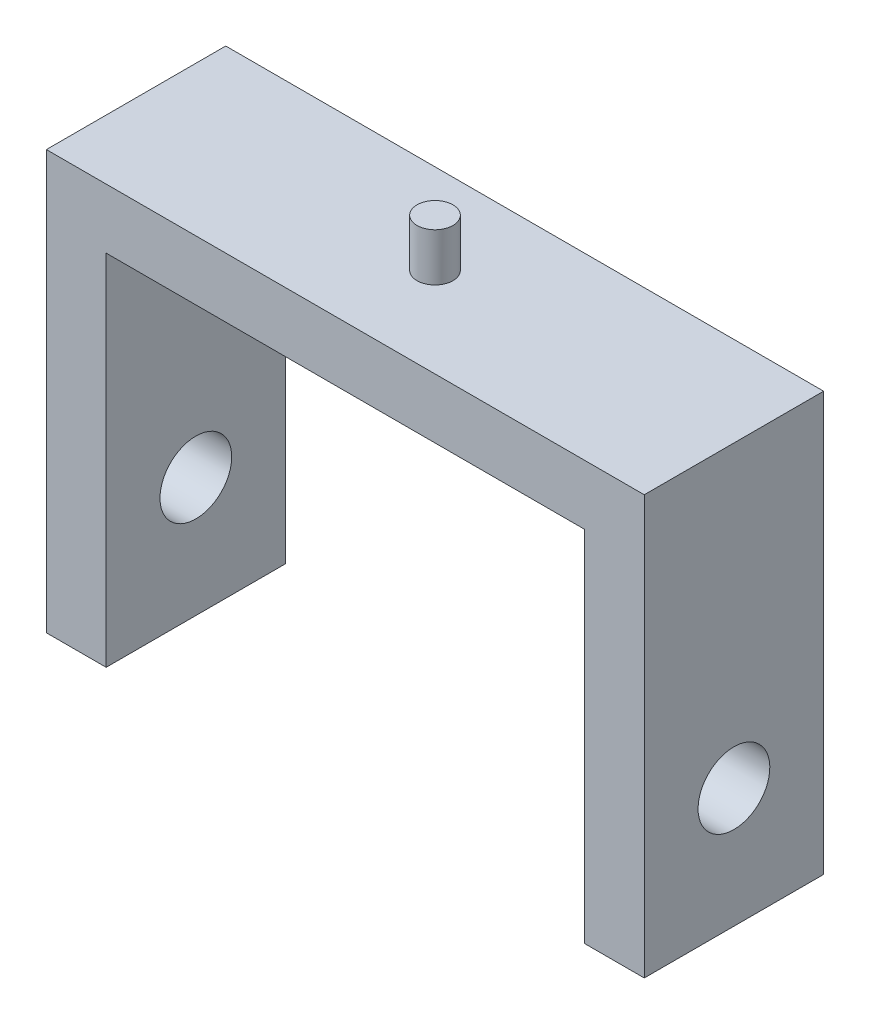
ISO-10303-21;
HEADER;
FILE_DESCRIPTION(('STEP AP214'),'2;1');
FILE_NAME('part.step','',(''),(''),'','','');
FILE_SCHEMA(('AUTOMOTIVE_DESIGN { 1 0 10303 214 1 1 1 1 }'));
ENDSEC;
DATA;
#1=APPLICATION_CONTEXT('core data for automotive mechanical design processes');
#2=APPLICATION_PROTOCOL_DEFINITION('international standard','automotive_design',2000,#1);
#3=PRODUCT_CONTEXT('',#1,'mechanical');
#4=PRODUCT('Part','Part','',(#3));
#5=PRODUCT_RELATED_PRODUCT_CATEGORY('part','',(#4));
#6=PRODUCT_DEFINITION_FORMATION('','',#4);
#7=PRODUCT_DEFINITION_CONTEXT('part definition',#1,'design');
#8=PRODUCT_DEFINITION('design','',#6,#7);
#9=PRODUCT_DEFINITION_SHAPE('','',#8);
#10=(LENGTH_UNIT() NAMED_UNIT(*) SI_UNIT(.MILLI.,.METRE.));
#11=(NAMED_UNIT(*) PLANE_ANGLE_UNIT() SI_UNIT($,.RADIAN.));
#12=(NAMED_UNIT(*) SI_UNIT($,.STERADIAN.) SOLID_ANGLE_UNIT());
#13=UNCERTAINTY_MEASURE_WITH_UNIT(LENGTH_MEASURE(1.E-05),#10,'distance_accuracy_value','');
#14=(GEOMETRIC_REPRESENTATION_CONTEXT(3) GLOBAL_UNCERTAINTY_ASSIGNED_CONTEXT((#13)) GLOBAL_UNIT_ASSIGNED_CONTEXT((#10,
#11,#12)) REPRESENTATION_CONTEXT('',''));
#15=CARTESIAN_POINT('',(0.,0.,0.));
#16=DIRECTION('',(0.,0.,1.));
#17=DIRECTION('',(1.,0.,0.));
#18=AXIS2_PLACEMENT_3D('',#15,#16,#17);
#19=CARTESIAN_POINT('',(-25.,15.,7.5));
#20=DIRECTION('',(1.,0.,0.));
#21=DIRECTION('',(0.,1.,0.));
#22=AXIS2_PLACEMENT_3D('',#19,#20,#21);
#23=PLANE('',#22);
#24=CARTESIAN_POINT('',(-25.,-5.,0.));
#25=DIRECTION('',(1.,0.,0.));
#26=DIRECTION('',(0.,1.,0.));
#27=AXIS2_PLACEMENT_3D('',#24,#25,#26);
#28=CIRCLE('',#27,3.);
#29=CARTESIAN_POINT('',(-25.,-2.,0.));
#30=VERTEX_POINT('',#29);
#31=EDGE_CURVE('E234',#30,#30,#28,.T.);
#32=ORIENTED_EDGE('',*,*,#31,.T.);
#33=EDGE_LOOP('',(#32));
#34=FACE_BOUND('',#33,.T.);
#35=DIRECTION('',(0.,-1.,0.));
#36=VECTOR('',#35,1.);
#37=CARTESIAN_POINT('',(-25.,15.,-7.5));
#38=LINE('',#37,#36);
#39=CARTESIAN_POINT('',(-25.,20.,-7.5));
#40=VERTEX_POINT('',#39);
#41=CARTESIAN_POINT('',(-25.,-15.,-7.5));
#42=VERTEX_POINT('',#41);
#43=EDGE_CURVE('E144',#40,#42,#38,.T.);
#44=ORIENTED_EDGE('',*,*,#43,.T.);
#45=DIRECTION('',(0.,0.,-1.));
#46=VECTOR('',#45,1.);
#47=CARTESIAN_POINT('',(-25.,-15.,7.5));
#48=LINE('',#47,#46);
#49=CARTESIAN_POINT('',(-25.,-15.,7.5));
#50=VERTEX_POINT('',#49);
#51=EDGE_CURVE('E49',#50,#42,#48,.T.);
#52=ORIENTED_EDGE('',*,*,#51,.F.);
#53=DIRECTION('',(0.,-1.,0.));
#54=VECTOR('',#53,1.);
#55=CARTESIAN_POINT('',(-25.,15.,7.5));
#56=LINE('',#55,#54);
#57=CARTESIAN_POINT('',(-25.,20.,7.5));
#58=VERTEX_POINT('',#57);
#59=EDGE_CURVE('E97',#58,#50,#56,.T.);
#60=ORIENTED_EDGE('',*,*,#59,.F.);
#61=DIRECTION('',(0.,0.,-1.));
#62=VECTOR('',#61,1.);
#63=CARTESIAN_POINT('',(-25.,20.,7.5));
#64=LINE('',#63,#62);
#65=EDGE_CURVE('E143',#58,#40,#64,.T.);
#66=ORIENTED_EDGE('',*,*,#65,.T.);
#67=EDGE_LOOP('',(#44,#52,#60,#66));
#68=FACE_BOUND('',#67,.T.);
#69=ADVANCED_FACE('F39',(#34,#68),#23,.F.);
#70=CARTESIAN_POINT('',(-20.,-15.,7.5));
#71=DIRECTION('',(0.,-1.,0.));
#72=DIRECTION('',(0.,0.,-1.));
#73=AXIS2_PLACEMENT_3D('',#70,#71,#72);
#74=PLANE('',#73);
#75=DIRECTION('',(-1.,0.,0.));
#76=VECTOR('',#75,1.);
#77=CARTESIAN_POINT('',(-20.,-15.,-7.5));
#78=LINE('',#77,#76);
#79=CARTESIAN_POINT('',(-20.,-15.,-7.5));
#80=VERTEX_POINT('',#79);
#81=EDGE_CURVE('E148',#80,#42,#78,.T.);
#82=ORIENTED_EDGE('',*,*,#81,.F.);
#83=DIRECTION('',(0.,0.,-1.));
#84=VECTOR('',#83,1.);
#85=CARTESIAN_POINT('',(-20.,-15.,7.5));
#86=LINE('',#85,#84);
#87=CARTESIAN_POINT('',(-20.,-15.,7.5));
#88=VERTEX_POINT('',#87);
#89=EDGE_CURVE('E183',#88,#80,#86,.T.);
#90=ORIENTED_EDGE('',*,*,#89,.F.);
#91=DIRECTION('',(-1.,0.,0.));
#92=VECTOR('',#91,1.);
#93=CARTESIAN_POINT('',(-20.,-15.,7.5));
#94=LINE('',#93,#92);
#95=EDGE_CURVE('E191',#88,#50,#94,.T.);
#96=ORIENTED_EDGE('',*,*,#95,.T.);
#97=ORIENTED_EDGE('',*,*,#51,.T.);
#98=EDGE_LOOP('',(#82,#90,#96,#97));
#99=FACE_BOUND('',#98,.T.);
#100=ADVANCED_FACE('F190',(#99),#74,.T.);
#101=CARTESIAN_POINT('',(-20.,15.,7.5));
#102=DIRECTION('',(1.,0.,0.));
#103=DIRECTION('',(0.,1.,0.));
#104=AXIS2_PLACEMENT_3D('',#101,#102,#103);
#105=PLANE('',#104);
#106=CARTESIAN_POINT('',(-20.,-5.,0.));
#107=DIRECTION('',(1.,0.,0.));
#108=DIRECTION('',(0.,1.,0.));
#109=AXIS2_PLACEMENT_3D('',#106,#107,#108);
#110=CIRCLE('',#109,3.);
#111=CARTESIAN_POINT('',(-20.,-2.,0.));
#112=VERTEX_POINT('',#111);
#113=EDGE_CURVE('E245',#112,#112,#110,.T.);
#114=ORIENTED_EDGE('',*,*,#113,.F.);
#115=EDGE_LOOP('',(#114));
#116=FACE_BOUND('',#115,.T.);
#117=DIRECTION('',(0.,-1.,0.));
#118=VECTOR('',#117,1.);
#119=CARTESIAN_POINT('',(-20.,15.,-7.5));
#120=LINE('',#119,#118);
#121=CARTESIAN_POINT('',(-20.,15.,-7.5));
#122=VERTEX_POINT('',#121);
#123=EDGE_CURVE('E153',#122,#80,#120,.T.);
#124=ORIENTED_EDGE('',*,*,#123,.F.);
#125=DIRECTION('',(0.,0.,-1.));
#126=VECTOR('',#125,1.);
#127=CARTESIAN_POINT('',(-20.,15.,7.5));
#128=LINE('',#127,#126);
#129=CARTESIAN_POINT('',(-20.,15.,7.5));
#130=VERTEX_POINT('',#129);
#131=EDGE_CURVE('E180',#130,#122,#128,.T.);
#132=ORIENTED_EDGE('',*,*,#131,.F.);
#133=DIRECTION('',(0.,-1.,0.));
#134=VECTOR('',#133,1.);
#135=CARTESIAN_POINT('',(-20.,15.,7.5));
#136=LINE('',#135,#134);
#137=EDGE_CURVE('E202',#130,#88,#136,.T.);
#138=ORIENTED_EDGE('',*,*,#137,.T.);
#139=ORIENTED_EDGE('',*,*,#89,.T.);
#140=EDGE_LOOP('',(#124,#132,#138,#139));
#141=FACE_BOUND('',#140,.T.);
#142=ADVANCED_FACE('F199',(#116,#141),#105,.T.);
#143=CARTESIAN_POINT('',(-20.,15.,7.5));
#144=DIRECTION('',(0.,-1.,0.));
#145=DIRECTION('',(0.,0.,-1.));
#146=AXIS2_PLACEMENT_3D('',#143,#144,#145);
#147=PLANE('',#146);
#148=DIRECTION('',(-1.,0.,0.));
#149=VECTOR('',#148,1.);
#150=CARTESIAN_POINT('',(-20.,15.,-7.5));
#151=LINE('',#150,#149);
#152=CARTESIAN_POINT('',(20.,15.,-7.5));
#153=VERTEX_POINT('',#152);
#154=EDGE_CURVE('E157',#153,#122,#151,.T.);
#155=ORIENTED_EDGE('',*,*,#154,.F.);
#156=DIRECTION('',(0.,0.,-1.));
#157=VECTOR('',#156,1.);
#158=CARTESIAN_POINT('',(20.,15.,7.5));
#159=LINE('',#158,#157);
#160=CARTESIAN_POINT('',(20.,15.,7.5));
#161=VERTEX_POINT('',#160);
#162=EDGE_CURVE('E177',#161,#153,#159,.T.);
#163=ORIENTED_EDGE('',*,*,#162,.F.);
#164=DIRECTION('',(-1.,0.,0.));
#165=VECTOR('',#164,1.);
#166=CARTESIAN_POINT('',(-20.,15.,7.5));
#167=LINE('',#166,#165);
#168=EDGE_CURVE('E137',#161,#130,#167,.T.);
#169=ORIENTED_EDGE('',*,*,#168,.T.);
#170=ORIENTED_EDGE('',*,*,#131,.T.);
#171=EDGE_LOOP('',(#155,#163,#169,#170));
#172=FACE_BOUND('',#171,.T.);
#173=ADVANCED_FACE('F213',(#172),#147,.T.);
#174=CARTESIAN_POINT('',(20.,15.,7.5));
#175=DIRECTION('',(-1.,0.,0.));
#176=DIRECTION('',(0.,-1.,0.));
#177=AXIS2_PLACEMENT_3D('',#174,#175,#176);
#178=PLANE('',#177);
#179=CARTESIAN_POINT('',(20.,-5.,0.));
#180=DIRECTION('',(-1.,0.,0.));
#181=DIRECTION('',(0.,-1.,0.));
#182=AXIS2_PLACEMENT_3D('',#179,#180,#181);
#183=CIRCLE('',#182,3.);
#184=CARTESIAN_POINT('',(20.,-8.,0.));
#185=VERTEX_POINT('',#184);
#186=EDGE_CURVE('E240',#185,#185,#183,.T.);
#187=ORIENTED_EDGE('',*,*,#186,.F.);
#188=EDGE_LOOP('',(#187));
#189=FACE_BOUND('',#188,.T.);
#190=DIRECTION('',(0.,1.,0.));
#191=VECTOR('',#190,1.);
#192=CARTESIAN_POINT('',(20.,15.,-7.5));
#193=LINE('',#192,#191);
#194=CARTESIAN_POINT('',(20.,-15.,-7.5));
#195=VERTEX_POINT('',#194);
#196=EDGE_CURVE('E161',#195,#153,#193,.T.);
#197=ORIENTED_EDGE('',*,*,#196,.F.);
#198=DIRECTION('',(0.,0.,-1.));
#199=VECTOR('',#198,1.);
#200=CARTESIAN_POINT('',(20.,-15.,7.5));
#201=LINE('',#200,#199);
#202=CARTESIAN_POINT('',(20.,-15.,7.5));
#203=VERTEX_POINT('',#202);
#204=EDGE_CURVE('E122',#203,#195,#201,.T.);
#205=ORIENTED_EDGE('',*,*,#204,.F.);
#206=DIRECTION('',(0.,1.,0.));
#207=VECTOR('',#206,1.);
#208=CARTESIAN_POINT('',(20.,15.,7.5));
#209=LINE('',#208,#207);
#210=EDGE_CURVE('E133',#203,#161,#209,.T.);
#211=ORIENTED_EDGE('',*,*,#210,.T.);
#212=ORIENTED_EDGE('',*,*,#162,.T.);
#213=EDGE_LOOP('',(#197,#205,#211,#212));
#214=FACE_BOUND('',#213,.T.);
#215=ADVANCED_FACE('F216',(#189,#214),#178,.T.);
#216=CARTESIAN_POINT('',(25.,-15.,7.5));
#217=DIRECTION('',(0.,-1.,0.));
#218=DIRECTION('',(1.,0.,0.));
#219=AXIS2_PLACEMENT_3D('',#216,#217,#218);
#220=PLANE('',#219);
#221=DIRECTION('',(-1.,0.,0.));
#222=VECTOR('',#221,1.);
#223=CARTESIAN_POINT('',(25.,-15.,-7.5));
#224=LINE('',#223,#222);
#225=CARTESIAN_POINT('',(25.,-15.,-7.5));
#226=VERTEX_POINT('',#225);
#227=EDGE_CURVE('E120',#226,#195,#224,.T.);
#228=ORIENTED_EDGE('',*,*,#227,.F.);
#229=DIRECTION('',(0.,0.,-1.));
#230=VECTOR('',#229,1.);
#231=CARTESIAN_POINT('',(25.,-15.,7.5));
#232=LINE('',#231,#230);
#233=CARTESIAN_POINT('',(25.,-15.,7.5));
#234=VERTEX_POINT('',#233);
#235=EDGE_CURVE('E114',#234,#226,#232,.T.);
#236=ORIENTED_EDGE('',*,*,#235,.F.);
#237=DIRECTION('',(-1.,0.,0.));
#238=VECTOR('',#237,1.);
#239=CARTESIAN_POINT('',(25.,-15.,7.5));
#240=LINE('',#239,#238);
#241=EDGE_CURVE('E118',#234,#203,#240,.T.);
#242=ORIENTED_EDGE('',*,*,#241,.T.);
#243=ORIENTED_EDGE('',*,*,#204,.T.);
#244=EDGE_LOOP('',(#228,#236,#242,#243));
#245=FACE_BOUND('',#244,.T.);
#246=ADVANCED_FACE('F116',(#245),#220,.T.);
#247=CARTESIAN_POINT('',(25.,15.,7.5));
#248=DIRECTION('',(-1.,0.,0.));
#249=DIRECTION('',(0.,-1.,0.));
#250=AXIS2_PLACEMENT_3D('',#247,#248,#249);
#251=PLANE('',#250);
#252=CARTESIAN_POINT('',(25.,-5.,0.));
#253=DIRECTION('',(-1.,0.,0.));
#254=DIRECTION('',(0.,-1.,0.));
#255=AXIS2_PLACEMENT_3D('',#252,#253,#254);
#256=CIRCLE('',#255,3.);
#257=CARTESIAN_POINT('',(25.,-8.,0.));
#258=VERTEX_POINT('',#257);
#259=EDGE_CURVE('E42',#258,#258,#256,.T.);
#260=ORIENTED_EDGE('',*,*,#259,.T.);
#261=EDGE_LOOP('',(#260));
#262=FACE_BOUND('',#261,.T.);
#263=DIRECTION('',(0.,1.,0.));
#264=VECTOR('',#263,1.);
#265=CARTESIAN_POINT('',(25.,15.,-7.5));
#266=LINE('',#265,#264);
#267=CARTESIAN_POINT('',(25.,20.,-7.5));
#268=VERTEX_POINT('',#267);
#269=EDGE_CURVE('E85',#226,#268,#266,.T.);
#270=ORIENTED_EDGE('',*,*,#269,.T.);
#271=DIRECTION('',(0.,0.,-1.));
#272=VECTOR('',#271,1.);
#273=CARTESIAN_POINT('',(25.,20.,7.5));
#274=LINE('',#273,#272);
#275=CARTESIAN_POINT('',(25.,20.,7.5));
#276=VERTEX_POINT('',#275);
#277=EDGE_CURVE('E123',#276,#268,#274,.T.);
#278=ORIENTED_EDGE('',*,*,#277,.F.);
#279=DIRECTION('',(0.,1.,0.));
#280=VECTOR('',#279,1.);
#281=CARTESIAN_POINT('',(25.,15.,7.5));
#282=LINE('',#281,#280);
#283=EDGE_CURVE('E125',#234,#276,#282,.T.);
#284=ORIENTED_EDGE('',*,*,#283,.F.);
#285=ORIENTED_EDGE('',*,*,#235,.T.);
#286=EDGE_LOOP('',(#270,#278,#284,#285));
#287=FACE_BOUND('',#286,.T.);
#288=ADVANCED_FACE('F126',(#262,#287),#251,.F.);
#289=CARTESIAN_POINT('',(-20.,20.,7.5));
#290=DIRECTION('',(0.,-1.,0.));
#291=DIRECTION('',(0.,0.,-1.));
#292=AXIS2_PLACEMENT_3D('',#289,#290,#291);
#293=PLANE('',#292);
#294=CARTESIAN_POINT('',(0.,20.,0.));
#295=DIRECTION('',(0.,-1.,0.));
#296=DIRECTION('',(0.,0.,-1.));
#297=AXIS2_PLACEMENT_3D('',#294,#295,#296);
#298=CIRCLE('',#297,1.5);
#299=CARTESIAN_POINT('',(0.,20.,-1.5));
#300=VERTEX_POINT('',#299);
#301=EDGE_CURVE('E11',#300,#300,#298,.F.);
#302=ORIENTED_EDGE('',*,*,#301,.F.);
#303=EDGE_LOOP('',(#302));
#304=FACE_BOUND('',#303,.T.);
#305=DIRECTION('',(1.,0.,0.));
#306=VECTOR('',#305,1.);
#307=CARTESIAN_POINT('',(-20.,20.,-7.5));
#308=LINE('',#307,#306);
#309=EDGE_CURVE('E91',#268,#40,#308,.F.);
#310=ORIENTED_EDGE('',*,*,#309,.T.);
#311=ORIENTED_EDGE('',*,*,#65,.F.);
#312=DIRECTION('',(1.,0.,0.));
#313=VECTOR('',#312,1.);
#314=CARTESIAN_POINT('',(-20.,20.,7.5));
#315=LINE('',#314,#313);
#316=EDGE_CURVE('E57',#276,#58,#315,.F.);
#317=ORIENTED_EDGE('',*,*,#316,.F.);
#318=ORIENTED_EDGE('',*,*,#277,.T.);
#319=EDGE_LOOP('',(#310,#311,#317,#318));
#320=FACE_BOUND('',#319,.T.);
#321=ADVANCED_FACE('F260',(#304,#320),#293,.F.);
#322=CARTESIAN_POINT('',(0.,0.,7.5));
#323=DIRECTION('',(0.,0.,-1.));
#324=DIRECTION('',(-1.,0.,0.));
#325=AXIS2_PLACEMENT_3D('',#322,#323,#324);
#326=PLANE('',#325);
#327=ORIENTED_EDGE('',*,*,#59,.T.);
#328=ORIENTED_EDGE('',*,*,#95,.F.);
#329=ORIENTED_EDGE('',*,*,#137,.F.);
#330=ORIENTED_EDGE('',*,*,#168,.F.);
#331=ORIENTED_EDGE('',*,*,#210,.F.);
#332=ORIENTED_EDGE('',*,*,#241,.F.);
#333=ORIENTED_EDGE('',*,*,#283,.T.);
#334=ORIENTED_EDGE('',*,*,#316,.T.);
#335=EDGE_LOOP('',(#327,#328,#329,#330,#331,#332,#333,#334));
#336=FACE_BOUND('',#335,.T.);
#337=ADVANCED_FACE('F130',(#336),#326,.F.);
#338=CARTESIAN_POINT('',(0.,0.,-7.5));
#339=DIRECTION('',(0.,0.,-1.));
#340=DIRECTION('',(-1.,0.,0.));
#341=AXIS2_PLACEMENT_3D('',#338,#339,#340);
#342=PLANE('',#341);
#343=ORIENTED_EDGE('',*,*,#43,.F.);
#344=ORIENTED_EDGE('',*,*,#309,.F.);
#345=ORIENTED_EDGE('',*,*,#269,.F.);
#346=ORIENTED_EDGE('',*,*,#227,.T.);
#347=ORIENTED_EDGE('',*,*,#196,.T.);
#348=ORIENTED_EDGE('',*,*,#154,.T.);
#349=ORIENTED_EDGE('',*,*,#123,.T.);
#350=ORIENTED_EDGE('',*,*,#81,.T.);
#351=EDGE_LOOP('',(#343,#344,#345,#346,#347,#348,#349,#350));
#352=FACE_BOUND('',#351,.T.);
#353=ADVANCED_FACE('F195',(#352),#342,.T.);
#354=CARTESIAN_POINT('',(0.,24.,0.));
#355=DIRECTION('',(0.,-1.,0.));
#356=DIRECTION('',(0.,0.,-1.));
#357=AXIS2_PLACEMENT_3D('',#354,#355,#356);
#358=CYLINDRICAL_SURFACE('',#357,1.5);
#359=CARTESIAN_POINT('',(0.,24.,0.));
#360=DIRECTION('',(0.,1.,0.));
#361=DIRECTION('',(0.,0.,1.));
#362=AXIS2_PLACEMENT_3D('',#359,#360,#361);
#363=CIRCLE('',#362,1.5);
#364=CARTESIAN_POINT('',(0.,24.,1.5));
#365=VERTEX_POINT('',#364);
#366=EDGE_CURVE('E149',#365,#365,#363,.T.);
#367=ORIENTED_EDGE('',*,*,#366,.F.);
#368=EDGE_LOOP('',(#367));
#369=FACE_BOUND('',#368,.T.);
#370=ORIENTED_EDGE('',*,*,#301,.T.);
#371=EDGE_LOOP('',(#370));
#372=FACE_BOUND('',#371,.T.);
#373=ADVANCED_FACE('F254',(#369,#372),#358,.T.);
#374=CARTESIAN_POINT('',(0.,24.,0.));
#375=DIRECTION('',(0.,1.,0.));
#376=DIRECTION('',(0.,0.,1.));
#377=AXIS2_PLACEMENT_3D('',#374,#375,#376);
#378=PLANE('',#377);
#379=ORIENTED_EDGE('',*,*,#366,.T.);
#380=EDGE_LOOP('',(#379));
#381=FACE_BOUND('',#380,.T.);
#382=ADVANCED_FACE('F252',(#381),#378,.T.);
#383=CARTESIAN_POINT('',(-25.,-5.,0.));
#384=DIRECTION('',(1.,0.,0.));
#385=DIRECTION('',(0.,1.,0.));
#386=AXIS2_PLACEMENT_3D('',#383,#384,#385);
#387=CYLINDRICAL_SURFACE('',#386,3.);
#388=ORIENTED_EDGE('',*,*,#186,.T.);
#389=EDGE_LOOP('',(#388));
#390=FACE_BOUND('',#389,.T.);
#391=ORIENTED_EDGE('',*,*,#259,.F.);
#392=EDGE_LOOP('',(#391));
#393=FACE_BOUND('',#392,.T.);
#394=ADVANCED_FACE('F275',(#390,#393),#387,.F.);
#395=ORIENTED_EDGE('',*,*,#113,.T.);
#396=EDGE_LOOP('',(#395));
#397=FACE_BOUND('',#396,.T.);
#398=ORIENTED_EDGE('',*,*,#31,.F.);
#399=EDGE_LOOP('',(#398));
#400=FACE_BOUND('',#399,.T.);
#401=ADVANCED_FACE('F276',(#397,#400),#387,.F.);
#402=CLOSED_SHELL('',(#69,#100,#142,#173,#215,#246,#288,#321,#337,#353,#373,#382,#394,#401));
#403=MANIFOLD_SOLID_BREP('B2',#402);
#404=ADVANCED_BREP_SHAPE_REPRESENTATION('',(#18,#403),#14);
#405=SHAPE_DEFINITION_REPRESENTATION(#9,#404);
ENDSEC;
END-ISO-10303-21;
